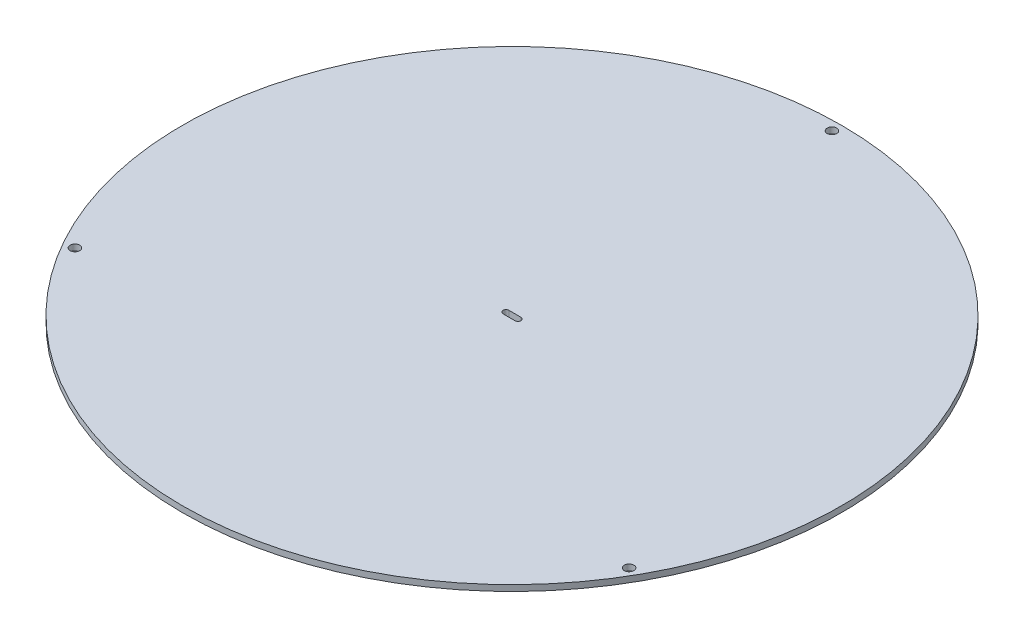
ISO-10303-21;
HEADER;
FILE_DESCRIPTION(('STEP AP214'),'2;1');
FILE_NAME('part.step','',(''),(''),'','','');
FILE_SCHEMA(('AUTOMOTIVE_DESIGN { 1 0 10303 214 1 1 1 1 }'));
ENDSEC;
DATA;
#1=APPLICATION_CONTEXT('core data for automotive mechanical design processes');
#2=APPLICATION_PROTOCOL_DEFINITION('international standard','automotive_design',2000,#1);
#3=PRODUCT_CONTEXT('',#1,'mechanical');
#4=PRODUCT('Part','Part','',(#3));
#5=PRODUCT_RELATED_PRODUCT_CATEGORY('part','',(#4));
#6=PRODUCT_DEFINITION_FORMATION('','',#4);
#7=PRODUCT_DEFINITION_CONTEXT('part definition',#1,'design');
#8=PRODUCT_DEFINITION('design','',#6,#7);
#9=PRODUCT_DEFINITION_SHAPE('','',#8);
#10=(LENGTH_UNIT() NAMED_UNIT(*) SI_UNIT(.MILLI.,.METRE.));
#11=(NAMED_UNIT(*) PLANE_ANGLE_UNIT() SI_UNIT($,.RADIAN.));
#12=(NAMED_UNIT(*) SI_UNIT($,.STERADIAN.) SOLID_ANGLE_UNIT());
#13=UNCERTAINTY_MEASURE_WITH_UNIT(LENGTH_MEASURE(1.E-05),#10,'distance_accuracy_value','');
#14=(GEOMETRIC_REPRESENTATION_CONTEXT(3) GLOBAL_UNCERTAINTY_ASSIGNED_CONTEXT((#13)) GLOBAL_UNIT_ASSIGNED_CONTEXT((#10,
#11,#12)) REPRESENTATION_CONTEXT('',''));
#15=CARTESIAN_POINT('',(0.,0.,0.));
#16=DIRECTION('',(0.,0.,1.));
#17=DIRECTION('',(1.,0.,0.));
#18=AXIS2_PLACEMENT_3D('',#15,#16,#17);
#19=CARTESIAN_POINT('',(0.,2.,0.));
#20=DIRECTION('',(0.,1.,0.));
#21=DIRECTION('',(0.,0.,1.));
#22=AXIS2_PLACEMENT_3D('',#19,#20,#21);
#23=PLANE('',#22);
#24=CARTESIAN_POINT('',(92.4915131241785,2.,53.3999999999991));
#25=DIRECTION('',(0.,1.,0.));
#26=DIRECTION('',(-0.866025403784443,0.,-0.499999999999992));
#27=AXIS2_PLACEMENT_3D('',#24,#25,#26);
#28=CIRCLE('',#27,1.6);
#29=CARTESIAN_POINT('',(91.1058724781234,2.,52.5999999999991));
#30=VERTEX_POINT('',#29);
#31=EDGE_CURVE('E197',#30,#30,#28,.T.);
#32=ORIENTED_EDGE('',*,*,#31,.F.);
#33=EDGE_LOOP('',(#32));
#34=FACE_BOUND('',#33,.T.);
#35=CARTESIAN_POINT('',(-92.4915131241778,2.,53.4000000000004));
#36=DIRECTION('',(0.,1.,0.));
#37=DIRECTION('',(0.866025403784436,0.,-0.500000000000004));
#38=AXIS2_PLACEMENT_3D('',#35,#36,#37);
#39=CIRCLE('',#38,1.6);
#40=CARTESIAN_POINT('',(-91.1058724781227,2.,52.6000000000004));
#41=VERTEX_POINT('',#40);
#42=EDGE_CURVE('E199',#41,#41,#39,.T.);
#43=ORIENTED_EDGE('',*,*,#42,.F.);
#44=EDGE_LOOP('',(#43));
#45=FACE_BOUND('',#44,.T.);
#46=CARTESIAN_POINT('',(0.,2.,-106.8));
#47=DIRECTION('',(0.,1.,0.));
#48=DIRECTION('',(0.,0.,1.));
#49=AXIS2_PLACEMENT_3D('',#46,#47,#48);
#50=CIRCLE('',#49,1.6);
#51=CARTESIAN_POINT('',(0.,2.,-105.2));
#52=VERTEX_POINT('',#51);
#53=EDGE_CURVE('E205',#52,#52,#50,.T.);
#54=ORIENTED_EDGE('',*,*,#53,.F.);
#55=EDGE_LOOP('',(#54));
#56=FACE_BOUND('',#55,.T.);
#57=CARTESIAN_POINT('',(0.,2.,0.));
#58=DIRECTION('',(0.,1.,0.));
#59=DIRECTION('',(0.,0.,1.));
#60=AXIS2_PLACEMENT_3D('',#57,#58,#59);
#61=CIRCLE('',#60,110.);
#62=CARTESIAN_POINT('',(0.,2.,110.));
#63=VERTEX_POINT('',#62);
#64=EDGE_CURVE('E11',#63,#63,#61,.T.);
#65=ORIENTED_EDGE('',*,*,#64,.T.);
#66=EDGE_LOOP('',(#65));
#67=FACE_BOUND('',#66,.T.);
#68=DIRECTION('',(1.,0.,0.));
#69=VECTOR('',#68,1.);
#70=CARTESIAN_POINT('',(-2.,2.,1.));
#71=LINE('',#70,#69);
#72=CARTESIAN_POINT('',(-2.,2.,1.));
#73=VERTEX_POINT('',#72);
#74=CARTESIAN_POINT('',(2.,2.,1.));
#75=VERTEX_POINT('',#74);
#76=EDGE_CURVE('E81',#73,#75,#71,.T.);
#77=ORIENTED_EDGE('',*,*,#76,.F.);
#78=CARTESIAN_POINT('',(-2.,2.,0.));
#79=DIRECTION('',(0.,1.,0.));
#80=DIRECTION('',(0.,0.,1.));
#81=AXIS2_PLACEMENT_3D('',#78,#79,#80);
#82=CIRCLE('',#81,1.);
#83=CARTESIAN_POINT('',(-2.,2.,-1.));
#84=VERTEX_POINT('',#83);
#85=EDGE_CURVE('E73',#84,#73,#82,.T.);
#86=ORIENTED_EDGE('',*,*,#85,.F.);
#87=DIRECTION('',(-1.,0.,0.));
#88=VECTOR('',#87,1.);
#89=CARTESIAN_POINT('',(-2.,2.,-1.));
#90=LINE('',#89,#88);
#91=CARTESIAN_POINT('',(2.,2.,-1.));
#92=VERTEX_POINT('',#91);
#93=EDGE_CURVE('E94',#92,#84,#90,.T.);
#94=ORIENTED_EDGE('',*,*,#93,.F.);
#95=CARTESIAN_POINT('',(2.,2.,0.));
#96=DIRECTION('',(0.,1.,0.));
#97=DIRECTION('',(0.,0.,1.));
#98=AXIS2_PLACEMENT_3D('',#95,#96,#97);
#99=CIRCLE('',#98,1.);
#100=EDGE_CURVE('E92',#75,#92,#99,.T.);
#101=ORIENTED_EDGE('',*,*,#100,.F.);
#102=EDGE_LOOP('',(#77,#86,#94,#101));
#103=FACE_BOUND('',#102,.T.);
#104=ADVANCED_FACE('F32',(#34,#45,#56,#67,#103),#23,.T.);
#105=CARTESIAN_POINT('',(0.,0.,0.));
#106=DIRECTION('',(0.,1.,0.));
#107=DIRECTION('',(0.,0.,1.));
#108=AXIS2_PLACEMENT_3D('',#105,#106,#107);
#109=PLANE('',#108);
#110=CARTESIAN_POINT('',(92.4915131241785,0.,53.3999999999991));
#111=DIRECTION('',(0.,1.,0.));
#112=DIRECTION('',(-0.866025403784443,0.,-0.499999999999992));
#113=AXIS2_PLACEMENT_3D('',#110,#111,#112);
#114=CIRCLE('',#113,1.6);
#115=CARTESIAN_POINT('',(91.1058724781234,0.,52.5999999999991));
#116=VERTEX_POINT('',#115);
#117=EDGE_CURVE('E195',#116,#116,#114,.T.);
#118=ORIENTED_EDGE('',*,*,#117,.T.);
#119=EDGE_LOOP('',(#118));
#120=FACE_BOUND('',#119,.T.);
#121=CARTESIAN_POINT('',(-92.4915131241778,0.,53.4000000000004));
#122=DIRECTION('',(0.,1.,0.));
#123=DIRECTION('',(0.866025403784436,0.,-0.500000000000004));
#124=AXIS2_PLACEMENT_3D('',#121,#122,#123);
#125=CIRCLE('',#124,1.6);
#126=CARTESIAN_POINT('',(-91.1058724781227,0.,52.6000000000004));
#127=VERTEX_POINT('',#126);
#128=EDGE_CURVE('E202',#127,#127,#125,.T.);
#129=ORIENTED_EDGE('',*,*,#128,.T.);
#130=EDGE_LOOP('',(#129));
#131=FACE_BOUND('',#130,.T.);
#132=CARTESIAN_POINT('',(0.,0.,-106.8));
#133=DIRECTION('',(0.,1.,0.));
#134=DIRECTION('',(0.,0.,1.));
#135=AXIS2_PLACEMENT_3D('',#132,#133,#134);
#136=CIRCLE('',#135,1.6);
#137=CARTESIAN_POINT('',(0.,0.,-105.2));
#138=VERTEX_POINT('',#137);
#139=EDGE_CURVE('E100',#138,#138,#136,.T.);
#140=ORIENTED_EDGE('',*,*,#139,.T.);
#141=EDGE_LOOP('',(#140));
#142=FACE_BOUND('',#141,.T.);
#143=CARTESIAN_POINT('',(0.,0.,0.));
#144=DIRECTION('',(0.,1.,0.));
#145=DIRECTION('',(0.,0.,1.));
#146=AXIS2_PLACEMENT_3D('',#143,#144,#145);
#147=CIRCLE('',#146,110.);
#148=CARTESIAN_POINT('',(0.,0.,110.));
#149=VERTEX_POINT('',#148);
#150=EDGE_CURVE('E36',#149,#149,#147,.T.);
#151=ORIENTED_EDGE('',*,*,#150,.F.);
#152=EDGE_LOOP('',(#151));
#153=FACE_BOUND('',#152,.T.);
#154=CARTESIAN_POINT('',(-2.,0.,0.));
#155=DIRECTION('',(0.,1.,0.));
#156=DIRECTION('',(0.,0.,1.));
#157=AXIS2_PLACEMENT_3D('',#154,#155,#156);
#158=CIRCLE('',#157,1.);
#159=CARTESIAN_POINT('',(-2.,0.,-1.));
#160=VERTEX_POINT('',#159);
#161=CARTESIAN_POINT('',(-2.,0.,1.));
#162=VERTEX_POINT('',#161);
#163=EDGE_CURVE('E55',#160,#162,#158,.T.);
#164=ORIENTED_EDGE('',*,*,#163,.T.);
#165=DIRECTION('',(1.,0.,0.));
#166=VECTOR('',#165,1.);
#167=CARTESIAN_POINT('',(-2.,0.,1.));
#168=LINE('',#167,#166);
#169=CARTESIAN_POINT('',(2.,0.,1.));
#170=VERTEX_POINT('',#169);
#171=EDGE_CURVE('E88',#162,#170,#168,.T.);
#172=ORIENTED_EDGE('',*,*,#171,.T.);
#173=CARTESIAN_POINT('',(2.,0.,0.));
#174=DIRECTION('',(0.,1.,0.));
#175=DIRECTION('',(0.,0.,1.));
#176=AXIS2_PLACEMENT_3D('',#173,#174,#175);
#177=CIRCLE('',#176,1.);
#178=CARTESIAN_POINT('',(2.,0.,-1.));
#179=VERTEX_POINT('',#178);
#180=EDGE_CURVE('E102',#170,#179,#177,.T.);
#181=ORIENTED_EDGE('',*,*,#180,.T.);
#182=DIRECTION('',(-1.,0.,0.));
#183=VECTOR('',#182,1.);
#184=CARTESIAN_POINT('',(-2.,0.,-1.));
#185=LINE('',#184,#183);
#186=EDGE_CURVE('E82',#179,#160,#185,.T.);
#187=ORIENTED_EDGE('',*,*,#186,.T.);
#188=EDGE_LOOP('',(#164,#172,#181,#187));
#189=FACE_BOUND('',#188,.T.);
#190=ADVANCED_FACE('F113',(#120,#131,#142,#153,#189),#109,.F.);
#191=CARTESIAN_POINT('',(0.,2.,0.));
#192=DIRECTION('',(0.,-1.,0.));
#193=DIRECTION('',(0.,0.,-1.));
#194=AXIS2_PLACEMENT_3D('',#191,#192,#193);
#195=CYLINDRICAL_SURFACE('',#194,110.);
#196=ORIENTED_EDGE('',*,*,#64,.F.);
#197=EDGE_LOOP('',(#196));
#198=FACE_BOUND('',#197,.T.);
#199=ORIENTED_EDGE('',*,*,#150,.T.);
#200=EDGE_LOOP('',(#199));
#201=FACE_BOUND('',#200,.T.);
#202=ADVANCED_FACE('F34',(#198,#201),#195,.T.);
#203=CARTESIAN_POINT('',(-2.,2.,0.));
#204=DIRECTION('',(0.,-1.,0.));
#205=DIRECTION('',(0.,0.,-1.));
#206=AXIS2_PLACEMENT_3D('',#203,#204,#205);
#207=CYLINDRICAL_SURFACE('',#206,1.);
#208=ORIENTED_EDGE('',*,*,#163,.F.);
#209=DIRECTION('',(0.,-1.,0.));
#210=VECTOR('',#209,1.);
#211=CARTESIAN_POINT('',(-2.,2.,-1.));
#212=LINE('',#211,#210);
#213=EDGE_CURVE('E77',#84,#160,#212,.T.);
#214=ORIENTED_EDGE('',*,*,#213,.F.);
#215=ORIENTED_EDGE('',*,*,#85,.T.);
#216=DIRECTION('',(0.,-1.,0.));
#217=VECTOR('',#216,1.);
#218=CARTESIAN_POINT('',(-2.,2.,1.));
#219=LINE('',#218,#217);
#220=EDGE_CURVE('E76',#73,#162,#219,.T.);
#221=ORIENTED_EDGE('',*,*,#220,.T.);
#222=EDGE_LOOP('',(#208,#214,#215,#221));
#223=FACE_BOUND('',#222,.T.);
#224=ADVANCED_FACE('F75',(#223),#207,.F.);
#225=CARTESIAN_POINT('',(-2.,2.,1.));
#226=DIRECTION('',(0.,0.,-1.));
#227=DIRECTION('',(-1.,0.,0.));
#228=AXIS2_PLACEMENT_3D('',#225,#226,#227);
#229=PLANE('',#228);
#230=ORIENTED_EDGE('',*,*,#171,.F.);
#231=ORIENTED_EDGE('',*,*,#220,.F.);
#232=ORIENTED_EDGE('',*,*,#76,.T.);
#233=DIRECTION('',(0.,-1.,0.));
#234=VECTOR('',#233,1.);
#235=CARTESIAN_POINT('',(2.,2.,1.));
#236=LINE('',#235,#234);
#237=EDGE_CURVE('E89',#75,#170,#236,.T.);
#238=ORIENTED_EDGE('',*,*,#237,.T.);
#239=EDGE_LOOP('',(#230,#231,#232,#238));
#240=FACE_BOUND('',#239,.T.);
#241=ADVANCED_FACE('F85',(#240),#229,.T.);
#242=CARTESIAN_POINT('',(2.,2.,0.));
#243=DIRECTION('',(0.,-1.,0.));
#244=DIRECTION('',(0.,0.,-1.));
#245=AXIS2_PLACEMENT_3D('',#242,#243,#244);
#246=CYLINDRICAL_SURFACE('',#245,1.);
#247=ORIENTED_EDGE('',*,*,#180,.F.);
#248=ORIENTED_EDGE('',*,*,#237,.F.);
#249=ORIENTED_EDGE('',*,*,#100,.T.);
#250=DIRECTION('',(0.,-1.,0.));
#251=VECTOR('',#250,1.);
#252=CARTESIAN_POINT('',(2.,2.,-1.));
#253=LINE('',#252,#251);
#254=EDGE_CURVE('E47',#92,#179,#253,.T.);
#255=ORIENTED_EDGE('',*,*,#254,.T.);
#256=EDGE_LOOP('',(#247,#248,#249,#255));
#257=FACE_BOUND('',#256,.T.);
#258=ADVANCED_FACE('F111',(#257),#246,.F.);
#259=CARTESIAN_POINT('',(-2.,2.,-1.));
#260=DIRECTION('',(0.,0.,1.));
#261=DIRECTION('',(1.,0.,0.));
#262=AXIS2_PLACEMENT_3D('',#259,#260,#261);
#263=PLANE('',#262);
#264=ORIENTED_EDGE('',*,*,#186,.F.);
#265=ORIENTED_EDGE('',*,*,#254,.F.);
#266=ORIENTED_EDGE('',*,*,#93,.T.);
#267=ORIENTED_EDGE('',*,*,#213,.T.);
#268=EDGE_LOOP('',(#264,#265,#266,#267));
#269=FACE_BOUND('',#268,.T.);
#270=ADVANCED_FACE('F114',(#269),#263,.T.);
#271=CARTESIAN_POINT('',(0.,0.,-106.8));
#272=DIRECTION('',(0.,1.,0.));
#273=DIRECTION('',(0.,0.,1.));
#274=AXIS2_PLACEMENT_3D('',#271,#272,#273);
#275=CYLINDRICAL_SURFACE('',#274,1.6);
#276=ORIENTED_EDGE('',*,*,#139,.F.);
#277=EDGE_LOOP('',(#276));
#278=FACE_BOUND('',#277,.T.);
#279=ORIENTED_EDGE('',*,*,#53,.T.);
#280=EDGE_LOOP('',(#279));
#281=FACE_BOUND('',#280,.T.);
#282=ADVANCED_FACE('F116',(#278,#281),#275,.F.);
#283=CARTESIAN_POINT('',(-92.4915131241778,0.,53.4000000000004));
#284=DIRECTION('',(0.,1.,0.));
#285=DIRECTION('',(0.,0.,1.));
#286=AXIS2_PLACEMENT_3D('',#283,#284,#285);
#287=CYLINDRICAL_SURFACE('',#286,1.6);
#288=ORIENTED_EDGE('',*,*,#128,.F.);
#289=EDGE_LOOP('',(#288));
#290=FACE_BOUND('',#289,.T.);
#291=ORIENTED_EDGE('',*,*,#42,.T.);
#292=EDGE_LOOP('',(#291));
#293=FACE_BOUND('',#292,.T.);
#294=ADVANCED_FACE('F122',(#290,#293),#287,.F.);
#295=CARTESIAN_POINT('',(92.4915131241785,0.,53.3999999999991));
#296=DIRECTION('',(0.,1.,0.));
#297=DIRECTION('',(0.,0.,1.));
#298=AXIS2_PLACEMENT_3D('',#295,#296,#297);
#299=CYLINDRICAL_SURFACE('',#298,1.6);
#300=ORIENTED_EDGE('',*,*,#117,.F.);
#301=EDGE_LOOP('',(#300));
#302=FACE_BOUND('',#301,.T.);
#303=ORIENTED_EDGE('',*,*,#31,.T.);
#304=EDGE_LOOP('',(#303));
#305=FACE_BOUND('',#304,.T.);
#306=ADVANCED_FACE('F178',(#302,#305),#299,.F.);
#307=CLOSED_SHELL('',(#104,#190,#202,#224,#241,#258,#270,#282,#294,#306));
#308=MANIFOLD_SOLID_BREP('B2',#307);
#309=ADVANCED_BREP_SHAPE_REPRESENTATION('',(#18,#308),#14);
#310=SHAPE_DEFINITION_REPRESENTATION(#9,#309);
ENDSEC;
END-ISO-10303-21;
